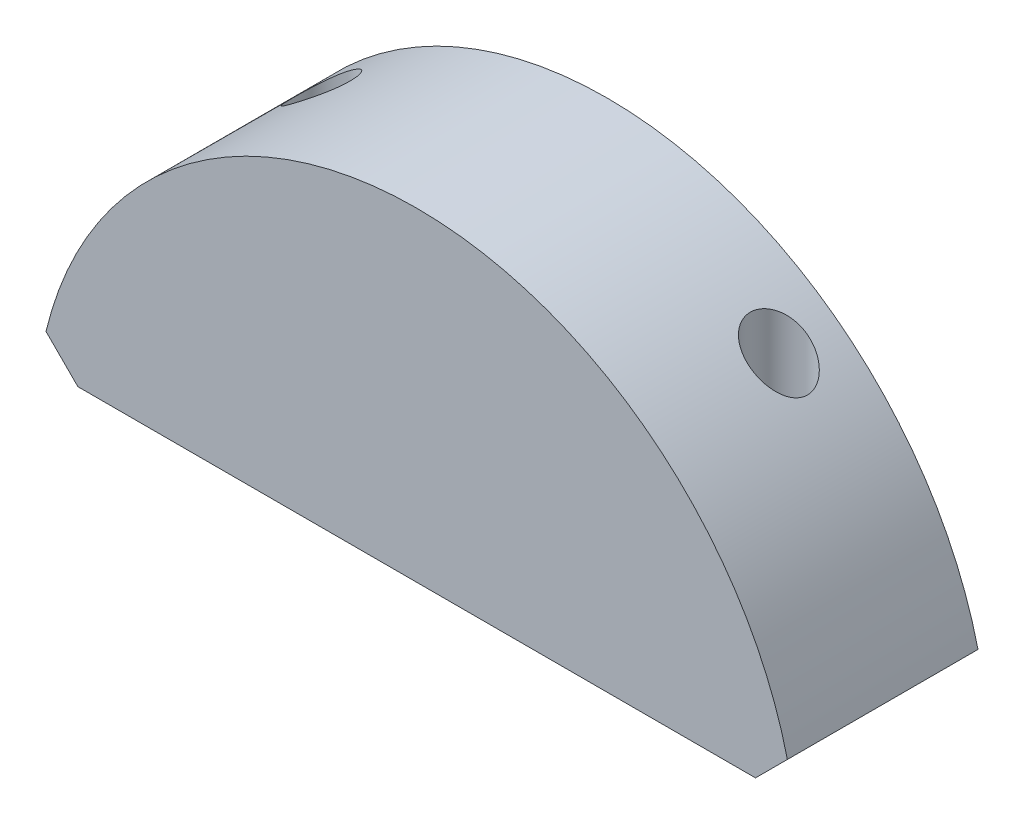
ISO-10303-21;
HEADER;
FILE_DESCRIPTION(('STEP AP214'),'2;1');
FILE_NAME('part.step','',(''),(''),'','','');
FILE_SCHEMA(('AUTOMOTIVE_DESIGN { 1 0 10303 214 1 1 1 1 }'));
ENDSEC;
DATA;
#1=APPLICATION_CONTEXT('core data for automotive mechanical design processes');
#2=APPLICATION_PROTOCOL_DEFINITION('international standard','automotive_design',2000,#1);
#3=PRODUCT_CONTEXT('',#1,'mechanical');
#4=PRODUCT('Part','Part','',(#3));
#5=PRODUCT_RELATED_PRODUCT_CATEGORY('part','',(#4));
#6=PRODUCT_DEFINITION_FORMATION('','',#4);
#7=PRODUCT_DEFINITION_CONTEXT('part definition',#1,'design');
#8=PRODUCT_DEFINITION('design','',#6,#7);
#9=PRODUCT_DEFINITION_SHAPE('','',#8);
#10=(LENGTH_UNIT() NAMED_UNIT(*) SI_UNIT(.MILLI.,.METRE.));
#11=(NAMED_UNIT(*) PLANE_ANGLE_UNIT() SI_UNIT($,.RADIAN.));
#12=(NAMED_UNIT(*) SI_UNIT($,.STERADIAN.) SOLID_ANGLE_UNIT());
#13=UNCERTAINTY_MEASURE_WITH_UNIT(LENGTH_MEASURE(1.E-05),#10,'distance_accuracy_value','');
#14=(GEOMETRIC_REPRESENTATION_CONTEXT(3) GLOBAL_UNCERTAINTY_ASSIGNED_CONTEXT((#13)) GLOBAL_UNIT_ASSIGNED_CONTEXT((#10,
#11,#12)) REPRESENTATION_CONTEXT('',''));
#15=CARTESIAN_POINT('',(0.,0.,0.));
#16=DIRECTION('',(0.,0.,1.));
#17=DIRECTION('',(1.,0.,0.));
#18=AXIS2_PLACEMENT_3D('',#15,#16,#17);
#19=CARTESIAN_POINT('',(-19.4464743814244,4.67275444813921,10.));
#20=DIRECTION('',(0.707106781186549,0.707106781186546,0.));
#21=DIRECTION('',(-0.707106781186546,0.707106781186549,0.));
#22=AXIS2_PLACEMENT_3D('',#19,#20,#21);
#23=PLANE('',#22);
#24=DIRECTION('',(0.707106781186546,-0.707106781186549,0.));
#25=VECTOR('',#24,1.);
#26=CARTESIAN_POINT('',(-19.4464743814244,4.67275444813921,0.));
#27=LINE('',#26,#25);
#28=CARTESIAN_POINT('',(-19.4464743814244,4.67275444813921,0.));
#29=VERTEX_POINT('',#28);
#30=CARTESIAN_POINT('',(-17.7737199332852,3.,0.));
#31=VERTEX_POINT('',#30);
#32=EDGE_CURVE('E101',#29,#31,#27,.T.);
#33=ORIENTED_EDGE('',*,*,#32,.T.);
#34=DIRECTION('',(0.,0.,-1.));
#35=VECTOR('',#34,1.);
#36=CARTESIAN_POINT('',(-17.7737199332852,3.,10.));
#37=LINE('',#36,#35);
#38=CARTESIAN_POINT('',(-17.7737199332852,3.,10.));
#39=VERTEX_POINT('',#38);
#40=EDGE_CURVE('E11',#39,#31,#37,.T.);
#41=ORIENTED_EDGE('',*,*,#40,.F.);
#42=DIRECTION('',(0.707106781186546,-0.707106781186549,0.));
#43=VECTOR('',#42,1.);
#44=CARTESIAN_POINT('',(-19.4464743814244,4.67275444813921,10.));
#45=LINE('',#44,#43);
#46=CARTESIAN_POINT('',(-19.4464743814244,4.67275444813921,10.));
#47=VERTEX_POINT('',#46);
#48=EDGE_CURVE('E88',#47,#39,#45,.T.);
#49=ORIENTED_EDGE('',*,*,#48,.F.);
#50=DIRECTION('',(0.,0.,-1.));
#51=VECTOR('',#50,1.);
#52=CARTESIAN_POINT('',(-19.4464743814244,4.67275444813921,10.));
#53=LINE('',#52,#51);
#54=EDGE_CURVE('E97',#47,#29,#53,.T.);
#55=ORIENTED_EDGE('',*,*,#54,.T.);
#56=EDGE_LOOP('',(#33,#41,#49,#55));
#57=FACE_BOUND('',#56,.T.);
#58=ADVANCED_FACE('F31',(#57),#23,.F.);
#59=CARTESIAN_POINT('',(17.7737199332852,3.,10.));
#60=DIRECTION('',(0.,1.,0.));
#61=DIRECTION('',(0.,0.,1.));
#62=AXIS2_PLACEMENT_3D('',#59,#60,#61);
#63=PLANE('',#62);
#64=CARTESIAN_POINT('',(12.,3.,3.));
#65=DIRECTION('',(0.,-1.,0.));
#66=DIRECTION('',(0.,0.,1.));
#67=AXIS2_PLACEMENT_3D('',#64,#65,#66);
#68=CIRCLE('',#67,1.5);
#69=CARTESIAN_POINT('',(12.,3.,4.5));
#70=VERTEX_POINT('',#69);
#71=EDGE_CURVE('E149',#70,#70,#68,.T.);
#72=ORIENTED_EDGE('',*,*,#71,.F.);
#73=EDGE_LOOP('',(#72));
#74=FACE_BOUND('',#73,.T.);
#75=CARTESIAN_POINT('',(-12.,3.,3.));
#76=DIRECTION('',(0.,-1.,0.));
#77=DIRECTION('',(0.,0.,-1.));
#78=AXIS2_PLACEMENT_3D('',#75,#76,#77);
#79=CIRCLE('',#78,1.5);
#80=CARTESIAN_POINT('',(-12.,3.,1.5));
#81=VERTEX_POINT('',#80);
#82=EDGE_CURVE('E113',#81,#81,#79,.T.);
#83=ORIENTED_EDGE('',*,*,#82,.F.);
#84=EDGE_LOOP('',(#83));
#85=FACE_BOUND('',#84,.T.);
#86=DIRECTION('',(1.,0.,0.));
#87=VECTOR('',#86,1.);
#88=CARTESIAN_POINT('',(17.7737199332852,3.,0.));
#89=LINE('',#88,#87);
#90=CARTESIAN_POINT('',(17.7737199332852,3.,0.));
#91=VERTEX_POINT('',#90);
#92=EDGE_CURVE('E92',#31,#91,#89,.T.);
#93=ORIENTED_EDGE('',*,*,#92,.T.);
#94=DIRECTION('',(0.,0.,-1.));
#95=VECTOR('',#94,1.);
#96=CARTESIAN_POINT('',(17.7737199332852,3.,10.));
#97=LINE('',#96,#95);
#98=CARTESIAN_POINT('',(17.7737199332852,3.,10.));
#99=VERTEX_POINT('',#98);
#100=EDGE_CURVE('E44',#99,#91,#97,.T.);
#101=ORIENTED_EDGE('',*,*,#100,.F.);
#102=DIRECTION('',(1.,0.,0.));
#103=VECTOR('',#102,1.);
#104=CARTESIAN_POINT('',(17.7737199332852,3.,10.));
#105=LINE('',#104,#103);
#106=EDGE_CURVE('E83',#39,#99,#105,.T.);
#107=ORIENTED_EDGE('',*,*,#106,.F.);
#108=ORIENTED_EDGE('',*,*,#40,.T.);
#109=EDGE_LOOP('',(#93,#101,#107,#108));
#110=FACE_BOUND('',#109,.T.);
#111=ADVANCED_FACE('F91',(#74,#85,#110),#63,.F.);
#112=CARTESIAN_POINT('',(19.4464743814244,4.67275444813921,10.));
#113=DIRECTION('',(-0.707106781186549,0.707106781186546,0.));
#114=DIRECTION('',(-0.707106781186546,-0.707106781186549,0.));
#115=AXIS2_PLACEMENT_3D('',#112,#113,#114);
#116=PLANE('',#115);
#117=DIRECTION('',(0.707106781186546,0.707106781186549,0.));
#118=VECTOR('',#117,1.);
#119=CARTESIAN_POINT('',(19.4464743814244,4.67275444813921,0.));
#120=LINE('',#119,#118);
#121=CARTESIAN_POINT('',(19.4464743814244,4.67275444813921,0.));
#122=VERTEX_POINT('',#121);
#123=EDGE_CURVE('E70',#91,#122,#120,.T.);
#124=ORIENTED_EDGE('',*,*,#123,.T.);
#125=DIRECTION('',(0.,0.,-1.));
#126=VECTOR('',#125,1.);
#127=CARTESIAN_POINT('',(19.4464743814244,4.67275444813921,10.));
#128=LINE('',#127,#126);
#129=CARTESIAN_POINT('',(19.4464743814244,4.67275444813921,10.));
#130=VERTEX_POINT('',#129);
#131=EDGE_CURVE('E93',#130,#122,#128,.T.);
#132=ORIENTED_EDGE('',*,*,#131,.F.);
#133=DIRECTION('',(0.707106781186546,0.707106781186549,0.));
#134=VECTOR('',#133,1.);
#135=CARTESIAN_POINT('',(19.4464743814244,4.67275444813921,10.));
#136=LINE('',#135,#134);
#137=EDGE_CURVE('E86',#99,#130,#136,.T.);
#138=ORIENTED_EDGE('',*,*,#137,.F.);
#139=ORIENTED_EDGE('',*,*,#100,.T.);
#140=EDGE_LOOP('',(#124,#132,#138,#139));
#141=FACE_BOUND('',#140,.T.);
#142=ADVANCED_FACE('F95',(#141),#116,.F.);
#143=CARTESIAN_POINT('',(0.,0.,10.));
#144=DIRECTION('',(0.,0.,-1.));
#145=DIRECTION('',(-1.,0.,0.));
#146=AXIS2_PLACEMENT_3D('',#143,#144,#145);
#147=CYLINDRICAL_SURFACE('',#146,20.);
#148=CARTESIAN_POINT('',(12.,16.,1.5));
#149=CARTESIAN_POINT('',(12.1016605629213,15.9237532135887,1.50000004935669));
#150=CARTESIAN_POINT('',(12.2026127311578,15.8465127533473,1.51032097749191));
#151=CARTESIAN_POINT('',(12.400646022508,15.692029679866,1.55095839595559));
#152=CARTESIAN_POINT('',(12.4977205734092,15.6147872679916,1.58130742401025));
#153=CARTESIAN_POINT('',(12.6897064755142,15.4592138939535,1.6636898259232));
#154=CARTESIAN_POINT('',(12.7843139264481,15.3809957521567,1.71665472820429));
#155=CARTESIAN_POINT('',(12.9629089448135,15.2307751019965,1.8446545508195));
#156=CARTESIAN_POINT('',(13.0469231451528,15.1587571563415,1.91963247924919));
#157=CARTESIAN_POINT('',(13.1708907683445,15.0509697154233,2.05968444424559));
#158=CARTESIAN_POINT('',(13.2155595966016,15.0117279077581,2.11794607225101));
#159=CARTESIAN_POINT('',(13.2971797886314,14.9394765813178,2.24310888920046));
#160=CARTESIAN_POINT('',(13.3341434417936,14.9064571463541,2.30999604067372));
#161=CARTESIAN_POINT('',(13.3928015616609,14.8537589270902,2.43942400994441));
#162=CARTESIAN_POINT('',(13.4160296580088,14.8327617291017,2.50072726708063));
#163=CARTESIAN_POINT('',(13.4545746078482,14.7978073911107,2.62770451371875));
#164=CARTESIAN_POINT('',(13.4698962264855,14.7838460108185,2.69337584362389));
#165=CARTESIAN_POINT('',(13.4916421076157,14.7640041775769,2.82778097939976));
#166=CARTESIAN_POINT('',(13.4980169893861,14.7581685755147,2.89652963762857));
#167=CARTESIAN_POINT('',(13.5011884754028,14.755267420131,3.034429926871));
#168=CARTESIAN_POINT('',(13.4979872687585,14.7581998624203,3.10358146217927));
#169=CARTESIAN_POINT('',(13.4830012003276,14.7718909613274,3.23367914475481));
#170=CARTESIAN_POINT('',(13.472021382519,14.7819154999464,3.2948005649622));
#171=CARTESIAN_POINT('',(13.4430616303673,14.8082569634209,3.41392436688357));
#172=CARTESIAN_POINT('',(13.4250804124258,14.8245750420944,3.47192617444431));
#173=CARTESIAN_POINT('',(13.3816034948475,14.8638351659176,3.58757468259506));
#174=CARTESIAN_POINT('',(13.3556818304176,14.8871505567923,3.64493207249858));
#175=CARTESIAN_POINT('',(13.2980418159378,14.93866067761,3.75426441770425));
#176=CARTESIAN_POINT('',(13.2663196593158,14.9668586110726,3.80623580314361));
#177=CARTESIAN_POINT('',(13.1803316644731,15.0427260154491,3.9301005770873));
#178=CARTESIAN_POINT('',(13.1229220222838,15.0928947956917,3.99829629684761));
#179=CARTESIAN_POINT('',(12.9998708818308,15.1990132172518,4.12155049099019));
#180=CARTESIAN_POINT('',(12.9342108196884,15.2549758433967,4.17657849984266));
#181=CARTESIAN_POINT('',(12.7798704471203,15.384647055898,4.28560543116445));
#182=CARTESIAN_POINT('',(12.6894951910277,15.4593402629862,4.3360376663896));
#183=CARTESIAN_POINT('',(12.5022544047574,15.6111562300716,4.41709380697447));
#184=CARTESIAN_POINT('',(12.4053874483738,15.6882795219658,4.44771334369915));
#185=CARTESIAN_POINT('',(12.2069126063823,15.8432077026678,4.48913684669305));
#186=CARTESIAN_POINT('',(12.1052767364364,15.9210136356196,4.49980331807073));
#187=CARTESIAN_POINT('',(11.9004066568021,16.0747230306896,4.50019129806755));
#188=CARTESIAN_POINT('',(11.7971717440038,16.1506256151288,4.48990331756371));
#189=CARTESIAN_POINT('',(11.5899659066436,16.2999799219,4.44683044842385));
#190=CARTESIAN_POINT('',(11.4860287279132,16.3733410304183,4.41355576711111));
#191=CARTESIAN_POINT('',(11.2842193016896,16.5130665721538,4.32281232383725));
#192=CARTESIAN_POINT('',(11.1863337294807,16.5794466204968,4.26539905840293));
#193=CARTESIAN_POINT('',(11.0315673658264,16.6826343905496,4.14819763134882));
#194=CARTESIAN_POINT('',(10.9715216369123,16.7221477658731,4.09492647133967));
#195=CARTESIAN_POINT('',(10.8591649159862,16.7953271487328,3.97728953681393));
#196=CARTESIAN_POINT('',(10.806849595253,16.8289964305881,3.91293001540785));
#197=CARTESIAN_POINT('',(10.7121014961134,16.8894665285848,3.77360389767993));
#198=CARTESIAN_POINT('',(10.6697416979466,16.9162167589897,3.69856507407423));
#199=CARTESIAN_POINT('',(10.5979555941409,16.9612839160065,3.54019315187877));
#200=CARTESIAN_POINT('',(10.5685197408551,16.979607068653,3.45686623218193));
#201=CARTESIAN_POINT('',(10.5273605290395,17.0051519510712,3.2956014016712));
#202=CARTESIAN_POINT('',(10.5138907603318,17.0134701997499,3.21828040882406));
#203=CARTESIAN_POINT('',(10.4992362845085,17.0225179869444,3.06205860237886));
#204=CARTESIAN_POINT('',(10.4980447598979,17.023251736754,2.9831586898644));
#205=CARTESIAN_POINT('',(10.5076087948478,17.0173493215066,2.83265056278279));
#206=CARTESIAN_POINT('',(10.5174310204263,17.0112889192493,2.76095738189619));
#207=CARTESIAN_POINT('',(10.5470279795145,16.9929544491812,2.62049671268836));
#208=CARTESIAN_POINT('',(10.5668022281685,16.9806806840812,2.55172908201334));
#209=CARTESIAN_POINT('',(10.6156676939691,16.950175007428,2.41796748732423));
#210=CARTESIAN_POINT('',(10.6448759171302,16.9318682092376,2.35303371512348));
#211=CARTESIAN_POINT('',(10.7112488596221,16.8899580945463,2.22924846857253));
#212=CARTESIAN_POINT('',(10.748415802057,16.8663532980698,2.17039870048799));
#213=CARTESIAN_POINT('',(10.8329398860586,16.8122022490995,2.05472177457169));
#214=CARTESIAN_POINT('',(10.8809116539043,16.781223570887,1.99854817905674));
#215=CARTESIAN_POINT('',(10.9828767468486,16.7146680692949,1.89512800668806));
#216=CARTESIAN_POINT('',(11.0368729409546,16.679089053808,1.8478857122846));
#217=CARTESIAN_POINT('',(11.1574088396454,16.5987406196212,1.7563920114594));
#218=CARTESIAN_POINT('',(11.2246335533111,16.553386112853,1.71355962226389));
#219=CARTESIAN_POINT('',(11.3627962910017,16.4588542389145,1.63981128319862));
#220=CARTESIAN_POINT('',(11.4337361929509,16.4096749322021,1.6089014271738));
#221=CARTESIAN_POINT('',(11.5867739353569,16.3020390843075,1.55548706424555));
#222=CARTESIAN_POINT('',(11.6691455209899,16.2431971369261,1.53454650227289));
#223=CARTESIAN_POINT('',(11.8345001333518,16.1231224094826,1.50679968712444));
#224=CARTESIAN_POINT('',(11.9174834246622,16.0618885388235,1.4999999599378));
#225=CARTESIAN_POINT('',(12.,16.,1.5));
#226=B_SPLINE_CURVE_WITH_KNOTS('',3,(#148,#149,#150,#151,#152,#153,#154,#155,#156,#157,#158,
#159,#160,#161,#162,#163,#164,#165,#166,#167,#168,#169,#170,#171,#172,#173,#174,#175,#176,#177,
#178,#179,#180,#181,#182,#183,#184,#185,#186,#187,#188,#189,#190,#191,#192,#193,#194,#195,#196,
#197,#198,#199,#200,#201,#202,#203,#204,#205,#206,#207,#208,#209,#210,#211,#212,#213,#214,#215,
#216,#217,#218,#219,#220,#221,#222,#223,#224,#225),.UNSPECIFIED.,.T.,.F.,(4,2,2,2,2,2,2,2,2,2,2,
2,2,2,2,2,2,2,2,2,2,2,2,2,2,2,2,2,2,2,2,2,2,2,2,2,2,2,4),(0.,0.380888747448679,
0.762397816573691,1.16142131309411,1.55942070996349,1.80831992799634,2.0568190736621,
2.26249204307297,2.46804091048419,2.67471988367374,2.88135161332349,3.06923797234161,
3.25715879364833,3.45778881821748,3.6585509818516,3.96373327729259,4.26961497597763,
4.65056330466912,5.03159560261999,5.41524402539657,5.79906622014661,6.19132971875761,
6.58269626178779,6.85005253143594,7.11725852021268,7.38636612164723,7.6552745822342,
7.89076947911889,8.12613361041183,8.34296500964325,8.55978584602022,8.77940632412541,
8.99908822889553,9.23845155373438,9.47792936089046,9.7520175092024,10.0262455643914,
10.3352654956433,10.644428007841),.UNSPECIFIED.);
#227=CARTESIAN_POINT('',(12.,16.,1.5));
#228=VERTEX_POINT('',#227);
#229=EDGE_CURVE('E34',#228,#228,#226,.T.);
#230=ORIENTED_EDGE('',*,*,#229,.T.);
#231=EDGE_LOOP('',(#230));
#232=FACE_BOUND('',#231,.T.);
#233=CARTESIAN_POINT('',(-12.,16.,1.5));
#234=CARTESIAN_POINT('',(-11.8980876048335,16.0764323170644,1.5000003600341));
#235=CARTESIAN_POINT('',(-11.795374042595,16.1519339106007,1.51037246279794));
#236=CARTESIAN_POINT('',(-11.5913536327377,16.2989669800117,1.55298029084801));
#237=CARTESIAN_POINT('',(-11.490048209334,16.3704946286235,1.58523671089141));
#238=CARTESIAN_POINT('',(-11.3142543425323,16.4923175647519,1.66324681195698));
#239=CARTESIAN_POINT('',(-11.238684524381,16.5438706292671,1.70460518809169));
#240=CARTESIAN_POINT('',(-11.0935488275665,16.6415381162207,1.80169184783767));
#241=CARTESIAN_POINT('',(-11.0239734845288,16.6876611556738,1.85739690400877));
#242=CARTESIAN_POINT('',(-10.9036247460083,16.7664950196489,1.9734244783802));
#243=CARTESIAN_POINT('',(-10.8515983746704,16.8001794997242,2.03178224968919));
#244=CARTESIAN_POINT('',(-10.7561004107026,16.8614804890711,2.15799817758912));
#245=CARTESIAN_POINT('',(-10.7126274551483,16.8890979651574,2.22585481765071));
#246=CARTESIAN_POINT('',(-10.6361897009943,16.9373414907645,2.37014029400427));
#247=CARTESIAN_POINT('',(-10.6032891874942,16.9579248158376,2.44661788923494));
#248=CARTESIAN_POINT('',(-10.5503692934813,16.9909003915396,2.60557412620413));
#249=CARTESIAN_POINT('',(-10.5303416713673,17.0032978831174,2.68804889064996));
#250=CARTESIAN_POINT('',(-10.5059450850056,17.0183811355177,2.84666531717342));
#251=CARTESIAN_POINT('',(-10.5000833890813,17.0219930061228,2.92249230541015));
#252=CARTESIAN_POINT('',(-10.4999184896842,17.0220948966151,3.07414954399625));
#253=CARTESIAN_POINT('',(-10.5056110395502,17.0185875331139,3.14997978290739));
#254=CARTESIAN_POINT('',(-10.5276429980599,17.0049664536379,3.29547769185223));
#255=CARTESIAN_POINT('',(-10.5434291725354,16.9951959546369,3.36526304483569));
#256=CARTESIAN_POINT('',(-10.5843294661826,16.969753845377,3.50089488696362));
#257=CARTESIAN_POINT('',(-10.6094442044875,16.9540818434367,3.566741114333));
#258=CARTESIAN_POINT('',(-10.6689917240703,16.9166749481416,3.69543796905904));
#259=CARTESIAN_POINT('',(-10.7037411921448,16.894733040342,3.75808090296772));
#260=CARTESIAN_POINT('',(-10.7806361565001,16.8457697707144,3.87643513553549));
#261=CARTESIAN_POINT('',(-10.822784220928,16.8187466448983,3.9321440157829));
#262=CARTESIAN_POINT('',(-10.9178890891895,16.7571845534856,4.04155760309163));
#263=CARTESIAN_POINT('',(-10.9715220318902,16.7221486702822,4.09439267118534));
#264=CARTESIAN_POINT('',(-11.0841830982763,16.6476860793537,4.1902774291558));
#265=CARTESIAN_POINT('',(-11.1432139512592,16.6082571481853,4.23332213002933));
#266=CARTESIAN_POINT('',(-11.274541163793,16.5194409670355,4.31552589431466));
#267=CARTESIAN_POINT('',(-11.3474700975539,16.4694598846249,4.35303035551361));
#268=CARTESIAN_POINT('',(-11.4962221492973,16.365974093831,4.41517346469698));
#269=CARTESIAN_POINT('',(-11.57204683658,16.3124674631152,4.43980502715793));
#270=CARTESIAN_POINT('',(-11.7381442890676,16.1934588757011,4.47984368956888));
#271=CARTESIAN_POINT('',(-11.8286439442075,16.1274849369142,4.4929128422832));
#272=CARTESIAN_POINT('',(-12.0091013673207,15.9935657699963,4.50269618316554));
#273=CARTESIAN_POINT('',(-12.0990586138851,15.9256189261905,4.49939656809969));
#274=CARTESIAN_POINT('',(-12.2890846402055,15.7795653555701,4.47541502690279));
#275=CARTESIAN_POINT('',(-12.3887946092472,15.7013746346254,4.45235201009592));
#276=CARTESIAN_POINT('',(-12.5825891709098,15.5465051671632,4.38603019746868));
#277=CARTESIAN_POINT('',(-12.6766737297221,15.4698264297345,4.34277128028547));
#278=CARTESIAN_POINT('',(-12.8411398943842,15.3334455836701,4.24499890082287));
#279=CARTESIAN_POINT('',(-12.9128361125113,15.2730688976113,4.1936358138155));
#280=CARTESIAN_POINT('',(-13.0483034816434,15.1574951967083,4.07659138836794));
#281=CARTESIAN_POINT('',(-13.1120862077628,15.1022906462167,4.0109313591837));
#282=CARTESIAN_POINT('',(-13.2148223778713,15.0123937614299,3.8827425817465));
#283=CARTESIAN_POINT('',(-13.2560565832223,14.9759628036903,3.82326569708388));
#284=CARTESIAN_POINT('',(-13.3306489346558,14.9096037748145,3.69625877104046));
#285=CARTESIAN_POINT('',(-13.3640173563308,14.8796672237292,3.62873941171168));
#286=CARTESIAN_POINT('',(-13.4160912652458,14.8327177492785,3.49872011198761));
#287=CARTESIAN_POINT('',(-13.4363251312712,14.8143729529233,3.43731832757045));
#288=CARTESIAN_POINT('',(-13.4688959978802,14.7847668318338,3.31080612958904));
#289=CARTESIAN_POINT('',(-13.4812382565596,14.7735007906854,3.24569821694375));
#290=CARTESIAN_POINT('',(-13.4972125275386,14.7589084124947,3.11323211597964));
#291=CARTESIAN_POINT('',(-13.5008065126064,14.7556167389417,3.04586538928481));
#292=CARTESIAN_POINT('',(-13.498888726625,14.7573711983825,2.91137397683958));
#293=CARTESIAN_POINT('',(-13.4933773865565,14.7624169367433,2.84424927978396));
#294=CARTESIAN_POINT('',(-13.4743664275154,14.7797697752896,2.71698321890953));
#295=CARTESIAN_POINT('',(-13.4614456888825,14.7915505002326,2.65667996533801));
#296=CARTESIAN_POINT('',(-13.4288598155293,14.8211405270667,2.53949536743534));
#297=CARTESIAN_POINT('',(-13.409192016344,14.8389522105928,2.48261538542665));
#298=CARTESIAN_POINT('',(-13.3564790722021,14.886440101642,2.35486471316348));
#299=CARTESIAN_POINT('',(-13.3211599585108,14.9180920605353,2.28566605417657));
#300=CARTESIAN_POINT('',(-13.2422954098062,14.9881420541817,2.15590632220091));
#301=CARTESIAN_POINT('',(-13.1987348329528,15.0265524968956,2.09536151394654));
#302=CARTESIAN_POINT('',(-13.0908551109943,15.1207161398019,1.9660109217337));
#303=CARTESIAN_POINT('',(-13.0242636211823,15.1781786427428,1.90035103105235));
#304=CARTESIAN_POINT('',(-12.8830820444135,15.2981964808271,1.78404266330934));
#305=CARTESIAN_POINT('',(-12.8084817401896,15.3607582963496,1.73341367942219));
#306=CARTESIAN_POINT('',(-12.6519333620279,15.4899672505474,1.64605381787775));
#307=CARTESIAN_POINT('',(-12.5698699134902,15.5566704339982,1.60961485293945));
#308=CARTESIAN_POINT('',(-12.4016331516331,15.6911140433194,1.55204375884532));
#309=CARTESIAN_POINT('',(-12.3154680566121,15.7588522245281,1.53088228976567));
#310=CARTESIAN_POINT('',(-12.1527976286699,15.8845389200665,1.50586275371052));
#311=CARTESIAN_POINT('',(-12.0766252699605,15.9425325357214,1.49999972929976));
#312=CARTESIAN_POINT('',(-12.,16.,1.5));
#313=B_SPLINE_CURVE_WITH_KNOTS('',3,(#233,#234,#235,#236,#237,#238,#239,#240,#241,#242,#243,
#244,#245,#246,#247,#248,#249,#250,#251,#252,#253,#254,#255,#256,#257,#258,#259,#260,#261,#262,
#263,#264,#265,#266,#267,#268,#269,#270,#271,#272,#273,#274,#275,#276,#277,#278,#279,#280,#281,
#282,#283,#284,#285,#286,#287,#288,#289,#290,#291,#292,#293,#294,#295,#296,#297,#298,#299,#300,
#301,#302,#303,#304,#305,#306,#307,#308,#309,#310,#311,#312),.UNSPECIFIED.,.T.,.F.,(4,2,2,2,2,2,
2,2,2,2,2,2,2,2,2,2,2,2,2,2,2,2,2,2,2,2,2,2,2,2,2,2,2,2,2,2,2,2,2,4),(0.,0.381852199418809,
0.764065999032913,1.06407114404965,1.36359359760288,1.6179247857578,1.87221541521554,
2.12802420556192,2.38366905608251,2.61090583488865,2.8380591099448,3.05371988379746,
3.26939497353044,3.49323274921014,3.7171483760326,3.9653010717218,4.21357993985852,
4.50060331369063,4.78778450548272,5.12472758268657,5.46195484098148,5.84664473760215,
6.23133694596236,6.55082545209374,6.86984098854433,7.11205322940871,7.35394727680873,
7.55471734421932,7.75535350083712,7.9568602429058,8.15835744736855,8.34591796191896,
8.5335526309587,8.78385434465488,9.03462047772725,9.36216090756058,9.69012427850932,
10.024516974717,10.3582657600676,10.6453704622747),.UNSPECIFIED.);
#314=CARTESIAN_POINT('',(-12.,16.,1.5));
#315=VERTEX_POINT('',#314);
#316=EDGE_CURVE('E104',#315,#315,#313,.T.);
#317=ORIENTED_EDGE('',*,*,#316,.T.);
#318=EDGE_LOOP('',(#317));
#319=FACE_BOUND('',#318,.T.);
#320=CARTESIAN_POINT('',(0.,0.,0.));
#321=DIRECTION('',(0.,0.,1.));
#322=DIRECTION('',(1.,0.,0.));
#323=AXIS2_PLACEMENT_3D('',#320,#321,#322);
#324=CIRCLE('',#323,20.);
#325=EDGE_CURVE('E76',#122,#29,#324,.T.);
#326=ORIENTED_EDGE('',*,*,#325,.T.);
#327=ORIENTED_EDGE('',*,*,#54,.F.);
#328=CARTESIAN_POINT('',(0.,0.,10.));
#329=DIRECTION('',(0.,0.,1.));
#330=DIRECTION('',(1.,0.,0.));
#331=AXIS2_PLACEMENT_3D('',#328,#329,#330);
#332=CIRCLE('',#331,20.);
#333=EDGE_CURVE('E53',#130,#47,#332,.T.);
#334=ORIENTED_EDGE('',*,*,#333,.F.);
#335=ORIENTED_EDGE('',*,*,#131,.T.);
#336=EDGE_LOOP('',(#326,#327,#334,#335));
#337=FACE_BOUND('',#336,.T.);
#338=ADVANCED_FACE('F114',(#232,#319,#337),#147,.T.);
#339=CARTESIAN_POINT('',(0.,0.,10.));
#340=DIRECTION('',(0.,0.,1.));
#341=DIRECTION('',(1.,0.,0.));
#342=AXIS2_PLACEMENT_3D('',#339,#340,#341);
#343=PLANE('',#342);
#344=ORIENTED_EDGE('',*,*,#48,.T.);
#345=ORIENTED_EDGE('',*,*,#106,.T.);
#346=ORIENTED_EDGE('',*,*,#137,.T.);
#347=ORIENTED_EDGE('',*,*,#333,.T.);
#348=EDGE_LOOP('',(#344,#345,#346,#347));
#349=FACE_BOUND('',#348,.T.);
#350=ADVANCED_FACE('F84',(#349),#343,.T.);
#351=CARTESIAN_POINT('',(0.,0.,0.));
#352=DIRECTION('',(0.,0.,1.));
#353=DIRECTION('',(1.,0.,0.));
#354=AXIS2_PLACEMENT_3D('',#351,#352,#353);
#355=PLANE('',#354);
#356=ORIENTED_EDGE('',*,*,#32,.F.);
#357=ORIENTED_EDGE('',*,*,#325,.F.);
#358=ORIENTED_EDGE('',*,*,#123,.F.);
#359=ORIENTED_EDGE('',*,*,#92,.F.);
#360=EDGE_LOOP('',(#356,#357,#358,#359));
#361=FACE_BOUND('',#360,.T.);
#362=ADVANCED_FACE('F123',(#361),#355,.F.);
#363=CARTESIAN_POINT('',(-12.,20.,3.));
#364=DIRECTION('',(0.,-1.,0.));
#365=DIRECTION('',(0.,0.,-1.));
#366=AXIS2_PLACEMENT_3D('',#363,#364,#365);
#367=CYLINDRICAL_SURFACE('',#366,1.5);
#368=ORIENTED_EDGE('',*,*,#82,.T.);
#369=EDGE_LOOP('',(#368));
#370=FACE_BOUND('',#369,.T.);
#371=ORIENTED_EDGE('',*,*,#316,.F.);
#372=EDGE_LOOP('',(#371));
#373=FACE_BOUND('',#372,.T.);
#374=ADVANCED_FACE('F118',(#370,#373),#367,.F.);
#375=CARTESIAN_POINT('',(12.,20.,3.));
#376=DIRECTION('',(0.,-1.,0.));
#377=DIRECTION('',(0.,0.,-1.));
#378=AXIS2_PLACEMENT_3D('',#375,#376,#377);
#379=CYLINDRICAL_SURFACE('',#378,1.5);
#380=ORIENTED_EDGE('',*,*,#71,.T.);
#381=EDGE_LOOP('',(#380));
#382=FACE_BOUND('',#381,.T.);
#383=ORIENTED_EDGE('',*,*,#229,.F.);
#384=EDGE_LOOP('',(#383));
#385=FACE_BOUND('',#384,.T.);
#386=ADVANCED_FACE('F122',(#382,#385),#379,.F.);
#387=CLOSED_SHELL('',(#58,#111,#142,#338,#350,#362,#374,#386));
#388=MANIFOLD_SOLID_BREP('B2',#387);
#389=ADVANCED_BREP_SHAPE_REPRESENTATION('',(#18,#388),#14);
#390=SHAPE_DEFINITION_REPRESENTATION(#9,#389);
ENDSEC;
END-ISO-10303-21;
